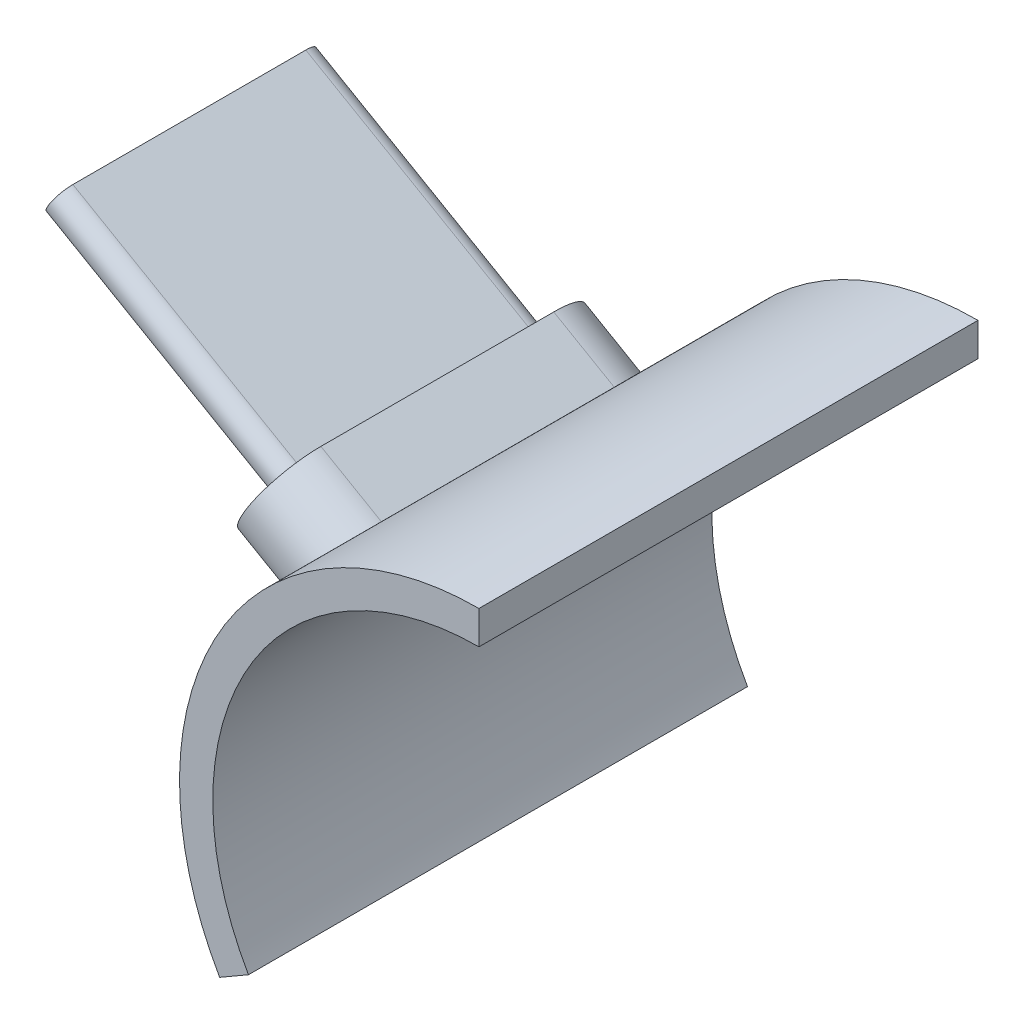
ISO-10303-21;
HEADER;
FILE_DESCRIPTION(('STEP AP214'),'2;1');
FILE_NAME('part.step','',(''),(''),'','','');
FILE_SCHEMA(('AUTOMOTIVE_DESIGN { 1 0 10303 214 1 1 1 1 }'));
ENDSEC;
DATA;
#1=APPLICATION_CONTEXT('core data for automotive mechanical design processes');
#2=APPLICATION_PROTOCOL_DEFINITION('international standard','automotive_design',2000,#1);
#3=PRODUCT_CONTEXT('',#1,'mechanical');
#4=PRODUCT('Part','Part','',(#3));
#5=PRODUCT_RELATED_PRODUCT_CATEGORY('part','',(#4));
#6=PRODUCT_DEFINITION_FORMATION('','',#4);
#7=PRODUCT_DEFINITION_CONTEXT('part definition',#1,'design');
#8=PRODUCT_DEFINITION('design','',#6,#7);
#9=PRODUCT_DEFINITION_SHAPE('','',#8);
#10=(LENGTH_UNIT() NAMED_UNIT(*) SI_UNIT(.MILLI.,.METRE.));
#11=(NAMED_UNIT(*) PLANE_ANGLE_UNIT() SI_UNIT($,.RADIAN.));
#12=(NAMED_UNIT(*) SI_UNIT($,.STERADIAN.) SOLID_ANGLE_UNIT());
#13=UNCERTAINTY_MEASURE_WITH_UNIT(LENGTH_MEASURE(1.E-05),#10,'distance_accuracy_value','');
#14=(GEOMETRIC_REPRESENTATION_CONTEXT(3) GLOBAL_UNCERTAINTY_ASSIGNED_CONTEXT((#13)) GLOBAL_UNIT_ASSIGNED_CONTEXT((#10,
#11,#12)) REPRESENTATION_CONTEXT('',''));
#15=CARTESIAN_POINT('',(0.,0.,0.));
#16=DIRECTION('',(0.,0.,1.));
#17=DIRECTION('',(1.,0.,0.));
#18=AXIS2_PLACEMENT_3D('',#15,#16,#17);
#19=CARTESIAN_POINT('',(0.,0.,-15.));
#20=DIRECTION('',(0.,0.,1.));
#21=DIRECTION('',(1.,0.,0.));
#22=AXIS2_PLACEMENT_3D('',#19,#20,#21);
#23=CYLINDRICAL_SURFACE('',#22,9.);
#24=CARTESIAN_POINT('',(0.,0.,0.));
#25=DIRECTION('',(0.,0.,1.));
#26=DIRECTION('',(1.,0.,0.));
#27=AXIS2_PLACEMENT_3D('',#24,#25,#26);
#28=CIRCLE('',#27,9.);
#29=CARTESIAN_POINT('',(0.,9.,0.));
#30=VERTEX_POINT('',#29);
#31=CARTESIAN_POINT('',(-7.79422863405995,-4.5,0.));
#32=VERTEX_POINT('',#31);
#33=EDGE_CURVE('E224',#30,#32,#28,.T.);
#34=ORIENTED_EDGE('',*,*,#33,.F.);
#35=DIRECTION('',(0.,0.,1.));
#36=VECTOR('',#35,1.);
#37=CARTESIAN_POINT('',(0.,9.,-15.));
#38=LINE('',#37,#36);
#39=CARTESIAN_POINT('',(0.,9.,-15.));
#40=VERTEX_POINT('',#39);
#41=EDGE_CURVE('E42',#40,#30,#38,.T.);
#42=ORIENTED_EDGE('',*,*,#41,.F.);
#43=CARTESIAN_POINT('',(0.,0.,-15.));
#44=DIRECTION('',(0.,0.,1.));
#45=DIRECTION('',(1.,0.,0.));
#46=AXIS2_PLACEMENT_3D('',#43,#44,#45);
#47=CIRCLE('',#46,9.);
#48=CARTESIAN_POINT('',(-7.79422863405995,-4.5,-15.));
#49=VERTEX_POINT('',#48);
#50=EDGE_CURVE('E238',#40,#49,#47,.T.);
#51=ORIENTED_EDGE('',*,*,#50,.T.);
#52=DIRECTION('',(0.,0.,1.));
#53=VECTOR('',#52,1.);
#54=CARTESIAN_POINT('',(-7.79422863405995,-4.5,-15.));
#55=LINE('',#54,#53);
#56=EDGE_CURVE('E228',#49,#32,#55,.T.);
#57=ORIENTED_EDGE('',*,*,#56,.T.);
#58=EDGE_LOOP('',(#34,#42,#51,#57));
#59=FACE_BOUND('',#58,.T.);
#60=DIRECTION('',(0.,0.,1.));
#61=VECTOR('',#60,1.);
#62=CARTESIAN_POINT('',(-6.9027682303927,5.77510093050167,-15.));
#63=LINE('',#62,#61);
#64=CARTESIAN_POINT('',(-6.90276823038147,5.77510093047241,-11.));
#65=VERTEX_POINT('',#64);
#66=CARTESIAN_POINT('',(-6.90276823030445,5.77510093040701,-4.00000000000002));
#67=VERTEX_POINT('',#66);
#68=EDGE_CURVE('E131',#65,#67,#63,.T.);
#69=ORIENTED_EDGE('',*,*,#68,.T.);
#70=CARTESIAN_POINT('',(-6.90276823038147,5.77510093047241,-4.00000000000002));
#71=CARTESIAN_POINT('',(-6.90276656012557,5.7751000768113,-3.95673706142056));
#72=CARTESIAN_POINT('',(-6.90394905667885,5.77368984360708,-3.91349517129641));
#73=CARTESIAN_POINT('',(-6.90865443831512,5.76805979386682,-3.8273272444447));
#74=CARTESIAN_POINT('',(-6.91217708068879,5.76384026869771,-3.78440117542836));
#75=CARTESIAN_POINT('',(-6.92619311311248,5.74700579029246,-3.65668125930244));
#76=CARTESIAN_POINT('',(-6.94013486813303,5.73021482392487,-3.57275310005166));
#77=CARTESIAN_POINT('',(-6.97653028283284,5.68584540154504,-3.40976931587298));
#78=CARTESIAN_POINT('',(-6.9989856695399,5.6582647567627,-3.33071468334683));
#79=CARTESIAN_POINT('',(-7.05134445339842,5.59287844897921,-3.17960231444207));
#80=CARTESIAN_POINT('',(-7.08124805188643,5.55507250957034,-3.10754476727856));
#81=CARTESIAN_POINT('',(-7.14747692440413,5.46959916990273,-2.97174357530146));
#82=CARTESIAN_POINT('',(-7.18385935644438,5.42184329230923,-2.90808351955007));
#83=CARTESIAN_POINT('',(-7.26130633177196,5.31767197783094,-2.79159955017666));
#84=CARTESIAN_POINT('',(-7.30237159228788,5.26125521397325,-2.73877729996561));
#85=CARTESIAN_POINT('',(-7.38780188681094,5.14061016034372,-2.64515893891145));
#86=CARTESIAN_POINT('',(-7.43218627472106,5.07633439871693,-2.60444158089755));
#87=CARTESIAN_POINT('',(-7.52230958901175,4.94180182845118,-2.53669706389918));
#88=CARTESIAN_POINT('',(-7.56804834418821,4.87154577368762,-2.50966818232274));
#89=CARTESIAN_POINT('',(-7.6587883222243,4.72759199504411,-2.47032349329807));
#90=CARTESIAN_POINT('',(-7.70379237590923,4.65393487457227,-2.4578657179893));
#91=CARTESIAN_POINT('',(-7.79206159911421,4.50458627160918,-2.44757509644643));
#92=CARTESIAN_POINT('',(-7.83532685326366,4.42889488842781,-2.4497415375654));
#93=CARTESIAN_POINT('',(-7.91844536375379,4.27849632161908,-2.46852814830906));
#94=CARTESIAN_POINT('',(-7.95832988076042,4.2037871989406,-2.484995127766));
#95=CARTESIAN_POINT('',(-8.03427347795219,4.05675986598687,-2.5316737814828));
#96=CARTESIAN_POINT('',(-8.0703324604456,3.98444171680176,-2.56188580664228));
#97=CARTESIAN_POINT('',(-8.13814892497099,3.84404034464471,-2.63534812000775));
#98=CARTESIAN_POINT('',(-8.16988457214322,3.77597949420322,-2.67866127386927));
#99=CARTESIAN_POINT('',(-8.22845541624945,3.64658378473835,-2.77704874019919));
#100=CARTESIAN_POINT('',(-8.25529036866384,3.58524926138523,-2.83212363922124));
#101=CARTESIAN_POINT('',(-8.30418277429193,3.47051788733601,-2.95331108653863));
#102=CARTESIAN_POINT('',(-8.32617451103861,3.41723297994059,-3.01955618888776));
#103=CARTESIAN_POINT('',(-8.36488687173686,3.32134772536017,-3.16078398358874));
#104=CARTESIAN_POINT('',(-8.38160600110984,3.27875040838851,-3.23576914517179));
#105=CARTESIAN_POINT('',(-8.40981251458721,3.20571288928587,-3.39251518925667));
#106=CARTESIAN_POINT('',(-8.42129030358781,3.17529499595326,-3.47428817723921));
#107=CARTESIAN_POINT('',(-8.43900459124829,3.12791498189281,-3.64211822813732));
#108=CARTESIAN_POINT('',(-8.44524892052809,3.11093276003902,-3.72816868572735));
#109=CARTESIAN_POINT('',(-8.45019184775187,3.09746103512405,-3.84573238699263));
#110=CARTESIAN_POINT('',(-8.45115894139542,3.09482071087173,-3.87654608855297));
#111=CARTESIAN_POINT('',(-8.45244620814087,3.09130351700679,-3.93823534579796));
#112=CARTESIAN_POINT('',(-8.45276746899528,3.09042368227782,-3.96911070965883));
#113=CARTESIAN_POINT('',(-8.45276823041337,3.09042217875073,-3.99999999999618));
#114=B_SPLINE_CURVE_WITH_KNOTS('',3,(#70,#71,#72,#73,#74,#75,#76,#77,#78,#79,#80,#81,#82,#83,
#84,#85,#86,#87,#88,#89,#90,#91,#92,#93,#94,#95,#96,#97,#98,#99,#100,#101,#102,#103,#104,#105,
#106,#107,#108,#109,#110,#111,#112,#113),.UNSPECIFIED.,.F.,.F.,(4,2,2,2,2,2,2,2,2,2,2,2,2,2,2,2,
2,2,2,2,2,4),(0.,0.129708064181739,0.259402677730728,0.518221537235833,0.777092927405544,
1.03597131602446,1.29725827954864,1.5585853160387,1.8215770666274,2.08453571345017,
2.34491040178055,2.60527240198601,2.86287928351456,3.12049274190214,3.37936251327546,
3.63824519739915,3.90044953013556,4.16272812090841,4.42548494808099,4.68784791708554,
4.78063019805032,4.87325607785096),.UNSPECIFIED.);
#115=CARTESIAN_POINT('',(-8.45276823031327,3.09042217867272,-4.00000000000001));
#116=VERTEX_POINT('',#115);
#117=EDGE_CURVE('E141',#67,#116,#114,.T.);
#118=ORIENTED_EDGE('',*,*,#117,.T.);
#119=DIRECTION('',(0.,0.,1.));
#120=VECTOR('',#119,1.);
#121=CARTESIAN_POINT('',(-8.45276823041012,3.09042217875961,-15.));
#122=LINE('',#121,#120);
#123=CARTESIAN_POINT('',(-8.45276823041696,3.09042217874091,-11.));
#124=VERTEX_POINT('',#123);
#125=EDGE_CURVE('E137',#116,#124,#122,.F.);
#126=ORIENTED_EDGE('',*,*,#125,.T.);
#127=CARTESIAN_POINT('',(-8.45276823045459,3.09042217879927,-11.));
#128=CARTESIAN_POINT('',(-8.45276665598757,3.09042115912177,-11.0432629385792));
#129=CARTESIAN_POINT('',(-8.45213660646545,3.09215034776536,-11.0865048287031));
#130=CARTESIAN_POINT('',(-8.44961353117242,3.09904035264977,-11.1726727555558));
#131=CARTESIAN_POINT('',(-8.44772063637798,3.10420081301477,-11.2155988245733));
#132=CARTESIAN_POINT('',(-8.44014956664546,3.1247562923436,-11.3433187407016));
#133=CARTESIAN_POINT('',(-8.43257904072712,3.14522568953695,-11.4272468999551));
#134=CARTESIAN_POINT('',(-8.41235170113984,3.19892975444215,-11.5902306841296));
#135=CARTESIAN_POINT('',(-8.39969385545417,3.2321670121893,-11.6692853166487));
#136=CARTESIAN_POINT('',(-8.36924704378071,3.3102042030222,-11.8203976855517));
#137=CARTESIAN_POINT('',(-8.35145793908506,3.35500444867444,-11.8924552327204));
#138=CARTESIAN_POINT('',(-8.31055029184703,3.45509700456702,-12.0282564247));
#139=CARTESIAN_POINT('',(-8.28738370469049,3.51048305376372,-12.0919164804488));
#140=CARTESIAN_POINT('',(-8.2358921876685,3.62963975908656,-12.2084004498128));
#141=CARTESIAN_POINT('',(-8.20756646722509,3.69341169983735,-12.2612227000169));
#142=CARTESIAN_POINT('',(-8.14579993320081,3.82771903196447,-12.3548410610739));
#143=CARTESIAN_POINT('',(-8.11232768473871,3.89829492024037,-12.3955584190968));
#144=CARTESIAN_POINT('',(-8.04088071839379,4.04361028502803,-12.4633029361024));
#145=CARTESIAN_POINT('',(-8.00290656778418,4.11834923633497,-12.4903318176773));
#146=CARTESIAN_POINT('',(-7.92360892752298,4.26890925177885,-12.5296765067015));
#147=CARTESIAN_POINT('',(-7.88232201686713,4.34471246577827,-12.5421342820121));
#148=CARTESIAN_POINT('',(-7.79711694428292,4.49583015692723,-12.5524249035552));
#149=CARTESIAN_POINT('',(-7.75319891067411,4.57114465771303,-12.5502584624345));
#150=CARTESIAN_POINT('',(-7.66450918636719,4.71832668272931,-12.5314718516839));
#151=CARTESIAN_POINT('',(-7.61975144673448,4.79022224901612,-12.5150048722211));
#152=CARTESIAN_POINT('',(-7.53039383993771,4.92950499992005,-12.4683262185012));
#153=CARTESIAN_POINT('',(-7.4857939768334,4.99689206938868,-12.4381141933447));
#154=CARTESIAN_POINT('',(-7.398111054077,5.1258235365456,-12.364651879993));
#155=CARTESIAN_POINT('',(-7.35503645217462,5.18733783842597,-12.3213387261434));
#156=CARTESIAN_POINT('',(-7.27226190269908,5.30275953206202,-12.2229512598057));
#157=CARTESIAN_POINT('',(-7.23256212356516,5.35666654422226,-12.1678763607639));
#158=CARTESIAN_POINT('',(-7.15764804184855,5.45637429656213,-12.0466889134369));
#159=CARTESIAN_POINT('',(-7.1224978267743,5.50206215296183,-11.9804438110983));
#160=CARTESIAN_POINT('',(-7.05881494080983,5.58353066805527,-11.839216016409));
#161=CARTESIAN_POINT('',(-7.03028414687195,5.61930851729945,-11.7642308548271));
#162=CARTESIAN_POINT('',(-6.98113505661614,5.68025483410069,-11.6074848107528));
#163=CARTESIAN_POINT('',(-6.96053128273305,5.70540383765408,-11.5257118227792));
#164=CARTESIAN_POINT('',(-6.92835613077477,5.74443486778446,-11.3578817718727));
#165=CARTESIAN_POINT('',(-6.91677125992379,5.75833372644027,-11.2718313142655));
#166=CARTESIAN_POINT('',(-6.90757586749639,5.76935028947844,-11.1542676129983));
#167=CARTESIAN_POINT('',(-6.90577282642489,5.77150797928752,-11.1234539114406));
#168=CARTESIAN_POINT('',(-6.90337048055001,5.77438138193561,-11.061764654199));
#169=CARTESIAN_POINT('',(-6.90276915175675,5.77509951935414,-11.0308892903389));
#170=CARTESIAN_POINT('',(-6.90276823041025,5.77510093048069,-10.9999999999985));
#171=B_SPLINE_CURVE_WITH_KNOTS('',3,(#127,#128,#129,#130,#131,#132,#133,#134,#135,#136,#137,
#138,#139,#140,#141,#142,#143,#144,#145,#146,#147,#148,#149,#150,#151,#152,#153,#154,#155,#156,
#157,#158,#159,#160,#161,#162,#163,#164,#165,#166,#167,#168,#169,#170),.UNSPECIFIED.,.F.,.F.,(4,
2,2,2,2,2,2,2,2,2,2,2,2,2,2,2,2,2,2,2,2,4),(0.,0.129708064180416,0.259402677730961,
0.518221537231424,0.77709292740258,1.03597131602412,1.29725827954323,1.55858531602877,
1.82157706663297,2.08453571346949,2.34491040179906,2.60527240200623,2.86287928354662,
3.12049274194263,3.37936251330388,3.63824519741953,3.90044953014789,4.16272812090916,
4.42548494809246,4.68784791710967,4.78063019807363,4.87325607787292),.UNSPECIFIED.);
#172=EDGE_CURVE('E49',#124,#65,#171,.T.);
#173=ORIENTED_EDGE('',*,*,#172,.T.);
#174=EDGE_LOOP('',(#69,#118,#126,#173));
#175=FACE_BOUND('',#174,.T.);
#176=ADVANCED_FACE('F35',(#59,#175),#23,.T.);
#177=CARTESIAN_POINT('',(0.,9.,-15.));
#178=DIRECTION('',(1.,0.,0.));
#179=DIRECTION('',(0.,0.,-1.));
#180=AXIS2_PLACEMENT_3D('',#177,#178,#179);
#181=PLANE('',#180);
#182=DIRECTION('',(0.,1.,0.));
#183=VECTOR('',#182,1.);
#184=CARTESIAN_POINT('',(0.,9.,0.));
#185=LINE('',#184,#183);
#186=CARTESIAN_POINT('',(0.,8.,0.));
#187=VERTEX_POINT('',#186);
#188=EDGE_CURVE('E235',#187,#30,#185,.T.);
#189=ORIENTED_EDGE('',*,*,#188,.F.);
#190=DIRECTION('',(0.,0.,1.));
#191=VECTOR('',#190,1.);
#192=CARTESIAN_POINT('',(0.,8.,-15.));
#193=LINE('',#192,#191);
#194=CARTESIAN_POINT('',(0.,8.,-15.));
#195=VERTEX_POINT('',#194);
#196=EDGE_CURVE('E246',#195,#187,#193,.T.);
#197=ORIENTED_EDGE('',*,*,#196,.F.);
#198=DIRECTION('',(0.,1.,0.));
#199=VECTOR('',#198,1.);
#200=CARTESIAN_POINT('',(0.,9.,-15.));
#201=LINE('',#200,#199);
#202=EDGE_CURVE('E249',#195,#40,#201,.T.);
#203=ORIENTED_EDGE('',*,*,#202,.T.);
#204=ORIENTED_EDGE('',*,*,#41,.T.);
#205=EDGE_LOOP('',(#189,#197,#203,#204));
#206=FACE_BOUND('',#205,.T.);
#207=ADVANCED_FACE('F206',(#206),#181,.T.);
#208=CARTESIAN_POINT('',(0.,0.,-15.));
#209=DIRECTION('',(0.,0.,1.));
#210=DIRECTION('',(1.,0.,0.));
#211=AXIS2_PLACEMENT_3D('',#208,#209,#210);
#212=CYLINDRICAL_SURFACE('',#211,8.);
#213=CARTESIAN_POINT('',(0.,0.,0.));
#214=DIRECTION('',(0.,0.,-1.));
#215=DIRECTION('',(1.,0.,0.));
#216=AXIS2_PLACEMENT_3D('',#213,#214,#215);
#217=CIRCLE('',#216,8.);
#218=CARTESIAN_POINT('',(-6.92820323027551,-3.99999999999999,0.));
#219=VERTEX_POINT('',#218);
#220=EDGE_CURVE('E237',#219,#187,#217,.T.);
#221=ORIENTED_EDGE('',*,*,#220,.F.);
#222=DIRECTION('',(0.,0.,1.));
#223=VECTOR('',#222,1.);
#224=CARTESIAN_POINT('',(-6.92820323027551,-3.99999999999999,-15.));
#225=LINE('',#224,#223);
#226=CARTESIAN_POINT('',(-6.92820323027551,-3.99999999999999,-15.));
#227=VERTEX_POINT('',#226);
#228=EDGE_CURVE('E248',#227,#219,#225,.T.);
#229=ORIENTED_EDGE('',*,*,#228,.F.);
#230=CARTESIAN_POINT('',(0.,0.,-15.));
#231=DIRECTION('',(0.,0.,-1.));
#232=DIRECTION('',(1.,0.,0.));
#233=AXIS2_PLACEMENT_3D('',#230,#231,#232);
#234=CIRCLE('',#233,8.);
#235=EDGE_CURVE('E251',#227,#195,#234,.T.);
#236=ORIENTED_EDGE('',*,*,#235,.T.);
#237=ORIENTED_EDGE('',*,*,#196,.T.);
#238=EDGE_LOOP('',(#221,#229,#236,#237));
#239=FACE_BOUND('',#238,.T.);
#240=ADVANCED_FACE('F209',(#239),#212,.F.);
#241=CARTESIAN_POINT('',(-7.79422863405995,-4.5,-15.));
#242=DIRECTION('',(0.5,-0.866025403784438,0.));
#243=DIRECTION('',(0.866025403784439,0.5,0.));
#244=AXIS2_PLACEMENT_3D('',#241,#242,#243);
#245=PLANE('',#244);
#246=DIRECTION('',(0.866025403784438,0.5,0.));
#247=VECTOR('',#246,1.);
#248=CARTESIAN_POINT('',(-7.79422863405995,-4.5,0.));
#249=LINE('',#248,#247);
#250=EDGE_CURVE('E230',#32,#219,#249,.T.);
#251=ORIENTED_EDGE('',*,*,#250,.F.);
#252=ORIENTED_EDGE('',*,*,#56,.F.);
#253=DIRECTION('',(0.866025403784438,0.5,0.));
#254=VECTOR('',#253,1.);
#255=CARTESIAN_POINT('',(-7.79422863405995,-4.5,-15.));
#256=LINE('',#255,#254);
#257=EDGE_CURVE('E240',#49,#227,#256,.T.);
#258=ORIENTED_EDGE('',*,*,#257,.T.);
#259=ORIENTED_EDGE('',*,*,#228,.T.);
#260=EDGE_LOOP('',(#251,#252,#258,#259));
#261=FACE_BOUND('',#260,.T.);
#262=ADVANCED_FACE('F201',(#261),#245,.T.);
#263=CARTESIAN_POINT('',(0.,0.,-15.));
#264=DIRECTION('',(0.,0.,1.));
#265=DIRECTION('',(1.,0.,0.));
#266=AXIS2_PLACEMENT_3D('',#263,#264,#265);
#267=PLANE('',#266);
#268=ORIENTED_EDGE('',*,*,#50,.F.);
#269=ORIENTED_EDGE('',*,*,#202,.F.);
#270=ORIENTED_EDGE('',*,*,#235,.F.);
#271=ORIENTED_EDGE('',*,*,#257,.F.);
#272=EDGE_LOOP('',(#268,#269,#270,#271));
#273=FACE_BOUND('',#272,.T.);
#274=ADVANCED_FACE('F198',(#273),#267,.F.);
#275=CARTESIAN_POINT('',(0.,0.,0.));
#276=DIRECTION('',(0.,0.,1.));
#277=DIRECTION('',(1.,0.,0.));
#278=AXIS2_PLACEMENT_3D('',#275,#276,#277);
#279=PLANE('',#278);
#280=ORIENTED_EDGE('',*,*,#33,.T.);
#281=ORIENTED_EDGE('',*,*,#250,.T.);
#282=ORIENTED_EDGE('',*,*,#220,.T.);
#283=ORIENTED_EDGE('',*,*,#188,.T.);
#284=EDGE_LOOP('',(#280,#281,#282,#283));
#285=FACE_BOUND('',#284,.T.);
#286=ADVANCED_FACE('F165',(#285),#279,.T.);
#287=CARTESIAN_POINT('',(-9.52627944162882,5.50000000000001,-3.99999999999995));
#288=DIRECTION('',(-0.866025403784438,0.500000000000001,0.));
#289=DIRECTION('',(-0.500000000000001,-0.866025403784438,0.));
#290=AXIS2_PLACEMENT_3D('',#287,#288,#289);
#291=PLANE('',#290);
#292=CARTESIAN_POINT('',(-9.52627944162882,5.50000000000001,-3.99999999999995));
#293=DIRECTION('',(-0.866025403784438,0.500000000000001,0.));
#294=DIRECTION('',(-0.500000000000001,-0.866025403784438,0.));
#295=AXIS2_PLACEMENT_3D('',#292,#293,#294);
#296=CIRCLE('',#295,1.55);
#297=CARTESIAN_POINT('',(-10.3012794416288,4.15766062413413,-4.00000000000001));
#298=VERTEX_POINT('',#297);
#299=CARTESIAN_POINT('',(-8.75127944162882,6.84233937586589,-4.00000000000002));
#300=VERTEX_POINT('',#299);
#301=EDGE_CURVE('E143',#298,#300,#296,.T.);
#302=ORIENTED_EDGE('',*,*,#301,.T.);
#303=DIRECTION('',(0.,0.,-1.));
#304=VECTOR('',#303,1.);
#305=CARTESIAN_POINT('',(-8.75127944162882,6.84233937586589,-4.00000000000002));
#306=LINE('',#305,#304);
#307=CARTESIAN_POINT('',(-8.75127944162882,6.84233937586589,-11.));
#308=VERTEX_POINT('',#307);
#309=EDGE_CURVE('E295',#300,#308,#306,.T.);
#310=ORIENTED_EDGE('',*,*,#309,.T.);
#311=CARTESIAN_POINT('',(-9.52627944162882,5.50000000000001,-10.9999999999999));
#312=DIRECTION('',(-0.866025403784438,0.500000000000001,0.));
#313=DIRECTION('',(-0.500000000000001,-0.866025403784438,0.));
#314=AXIS2_PLACEMENT_3D('',#311,#312,#313);
#315=CIRCLE('',#314,1.55);
#316=CARTESIAN_POINT('',(-10.3012794416288,4.15766062413413,-11.));
#317=VERTEX_POINT('',#316);
#318=EDGE_CURVE('E125',#308,#317,#315,.T.);
#319=ORIENTED_EDGE('',*,*,#318,.T.);
#320=DIRECTION('',(0.,0.,1.));
#321=VECTOR('',#320,1.);
#322=CARTESIAN_POINT('',(-10.3012794416288,4.15766062413413,-11.));
#323=LINE('',#322,#321);
#324=EDGE_CURVE('E292',#317,#298,#323,.T.);
#325=ORIENTED_EDGE('',*,*,#324,.T.);
#326=EDGE_LOOP('',(#302,#310,#319,#325));
#327=FACE_BOUND('',#326,.T.);
#328=CARTESIAN_POINT('',(-9.52627944162882,5.50000000000001,-11.));
#329=DIRECTION('',(-0.866025403784438,0.500000000000001,0.));
#330=DIRECTION('',(-0.500000000000001,-0.866025403784438,0.));
#331=AXIS2_PLACEMENT_3D('',#328,#329,#330);
#332=CIRCLE('',#331,0.5);
#333=CARTESIAN_POINT('',(-9.27627944162882,5.93301270189223,-11.));
#334=VERTEX_POINT('',#333);
#335=CARTESIAN_POINT('',(-9.77627944162882,5.06698729810779,-11.));
#336=VERTEX_POINT('',#335);
#337=EDGE_CURVE('E57',#334,#336,#332,.T.);
#338=ORIENTED_EDGE('',*,*,#337,.F.);
#339=DIRECTION('',(0.,0.,-1.));
#340=VECTOR('',#339,1.);
#341=CARTESIAN_POINT('',(-9.27627944162882,5.93301270189223,-11.));
#342=LINE('',#341,#340);
#343=CARTESIAN_POINT('',(-9.27627944162882,5.93301270189223,-4.));
#344=VERTEX_POINT('',#343);
#345=EDGE_CURVE('E11',#344,#334,#342,.T.);
#346=ORIENTED_EDGE('',*,*,#345,.F.);
#347=CARTESIAN_POINT('',(-9.52627944162882,5.50000000000001,-4.));
#348=DIRECTION('',(-0.866025403784438,0.500000000000001,0.));
#349=DIRECTION('',(-0.500000000000001,-0.866025403784438,0.));
#350=AXIS2_PLACEMENT_3D('',#347,#348,#349);
#351=CIRCLE('',#350,0.5);
#352=CARTESIAN_POINT('',(-9.77627944162882,5.06698729810779,-4.));
#353=VERTEX_POINT('',#352);
#354=EDGE_CURVE('E285',#353,#344,#351,.T.);
#355=ORIENTED_EDGE('',*,*,#354,.F.);
#356=DIRECTION('',(0.,0.,1.));
#357=VECTOR('',#356,1.);
#358=CARTESIAN_POINT('',(-9.77627944162882,5.06698729810779,-11.));
#359=LINE('',#358,#357);
#360=EDGE_CURVE('E282',#336,#353,#359,.T.);
#361=ORIENTED_EDGE('',*,*,#360,.F.);
#362=EDGE_LOOP('',(#338,#346,#355,#361));
#363=FACE_BOUND('',#362,.T.);
#364=ADVANCED_FACE('F161',(#327,#363),#291,.T.);
#365=CARTESIAN_POINT('',(-9.52627944162882,5.50000000000001,-3.99999999999995));
#366=DIRECTION('',(0.866025403784438,-0.500000000000001,0.));
#367=DIRECTION('',(0.500000000000001,0.866025403784438,0.));
#368=AXIS2_PLACEMENT_3D('',#365,#366,#367);
#369=CYLINDRICAL_SURFACE('',#368,1.55);
#370=DIRECTION('',(0.866025403784438,-0.500000000000001,0.));
#371=VECTOR('',#370,1.);
#372=CARTESIAN_POINT('',(-10.3012794416288,4.15766062413413,-4.00000000000001));
#373=LINE('',#372,#371);
#374=EDGE_CURVE('E290',#298,#116,#373,.T.);
#375=ORIENTED_EDGE('',*,*,#374,.T.);
#376=ORIENTED_EDGE('',*,*,#117,.F.);
#377=DIRECTION('',(0.866025403784438,-0.500000000000001,0.));
#378=VECTOR('',#377,1.);
#379=CARTESIAN_POINT('',(-8.75127944162882,6.84233937586589,-4.00000000000002));
#380=LINE('',#379,#378);
#381=EDGE_CURVE('E127',#300,#67,#380,.T.);
#382=ORIENTED_EDGE('',*,*,#381,.F.);
#383=ORIENTED_EDGE('',*,*,#301,.F.);
#384=EDGE_LOOP('',(#375,#376,#382,#383));
#385=FACE_BOUND('',#384,.T.);
#386=ADVANCED_FACE('F164',(#385),#369,.T.);
#387=CARTESIAN_POINT('',(-8.75127944162882,6.84233937586589,-4.00000000000002));
#388=DIRECTION('',(-0.500000000000001,-0.866025403784438,0.));
#389=DIRECTION('',(0.866025403784438,-0.500000000000001,0.));
#390=AXIS2_PLACEMENT_3D('',#387,#388,#389);
#391=PLANE('',#390);
#392=ORIENTED_EDGE('',*,*,#381,.T.);
#393=ORIENTED_EDGE('',*,*,#68,.F.);
#394=DIRECTION('',(0.866025403784438,-0.500000000000001,0.));
#395=VECTOR('',#394,1.);
#396=CARTESIAN_POINT('',(-8.75127944162882,6.84233937586589,-11.));
#397=LINE('',#396,#395);
#398=EDGE_CURVE('E122',#308,#65,#397,.T.);
#399=ORIENTED_EDGE('',*,*,#398,.F.);
#400=ORIENTED_EDGE('',*,*,#309,.F.);
#401=EDGE_LOOP('',(#392,#393,#399,#400));
#402=FACE_BOUND('',#401,.T.);
#403=ADVANCED_FACE('F132',(#402),#391,.F.);
#404=CARTESIAN_POINT('',(-9.52627944162882,5.50000000000001,-10.9999999999999));
#405=DIRECTION('',(0.866025403784438,-0.500000000000001,0.));
#406=DIRECTION('',(0.500000000000001,0.866025403784438,0.));
#407=AXIS2_PLACEMENT_3D('',#404,#405,#406);
#408=CYLINDRICAL_SURFACE('',#407,1.55);
#409=ORIENTED_EDGE('',*,*,#398,.T.);
#410=ORIENTED_EDGE('',*,*,#172,.F.);
#411=DIRECTION('',(0.866025403784438,-0.500000000000001,0.));
#412=VECTOR('',#411,1.);
#413=CARTESIAN_POINT('',(-10.3012794416288,4.15766062413413,-11.));
#414=LINE('',#413,#412);
#415=EDGE_CURVE('E128',#317,#124,#414,.T.);
#416=ORIENTED_EDGE('',*,*,#415,.F.);
#417=ORIENTED_EDGE('',*,*,#318,.F.);
#418=EDGE_LOOP('',(#409,#410,#416,#417));
#419=FACE_BOUND('',#418,.T.);
#420=ADVANCED_FACE('F124',(#419),#408,.T.);
#421=CARTESIAN_POINT('',(-10.3012794416288,4.15766062413413,-11.));
#422=DIRECTION('',(0.500000000000001,0.866025403784438,0.));
#423=DIRECTION('',(-0.866025403784438,0.500000000000001,0.));
#424=AXIS2_PLACEMENT_3D('',#421,#422,#423);
#425=PLANE('',#424);
#426=ORIENTED_EDGE('',*,*,#415,.T.);
#427=ORIENTED_EDGE('',*,*,#125,.F.);
#428=ORIENTED_EDGE('',*,*,#374,.F.);
#429=ORIENTED_EDGE('',*,*,#324,.F.);
#430=EDGE_LOOP('',(#426,#427,#428,#429));
#431=FACE_BOUND('',#430,.T.);
#432=ADVANCED_FACE('F167',(#431),#425,.F.);
#433=CARTESIAN_POINT('',(-16.4544826719043,9.50000000000002,-11.));
#434=DIRECTION('',(-0.866025403784438,0.500000000000001,0.));
#435=DIRECTION('',(-0.500000000000001,-0.866025403784438,0.));
#436=AXIS2_PLACEMENT_3D('',#433,#434,#435);
#437=PLANE('',#436);
#438=CARTESIAN_POINT('',(-16.4544826719043,9.50000000000002,-11.));
#439=DIRECTION('',(-0.866025403784438,0.500000000000001,0.));
#440=DIRECTION('',(-0.500000000000001,-0.866025403784438,0.));
#441=AXIS2_PLACEMENT_3D('',#438,#439,#440);
#442=CIRCLE('',#441,0.5);
#443=CARTESIAN_POINT('',(-16.2044826719043,9.93301270189224,-11.));
#444=VERTEX_POINT('',#443);
#445=CARTESIAN_POINT('',(-16.7044826719043,9.0669872981078,-11.));
#446=VERTEX_POINT('',#445);
#447=EDGE_CURVE('E278',#444,#446,#442,.T.);
#448=ORIENTED_EDGE('',*,*,#447,.T.);
#449=DIRECTION('',(0.,0.,1.));
#450=VECTOR('',#449,1.);
#451=CARTESIAN_POINT('',(-16.7044826719043,9.0669872981078,-11.));
#452=LINE('',#451,#450);
#453=CARTESIAN_POINT('',(-16.7044826719043,9.0669872981078,-4.));
#454=VERTEX_POINT('',#453);
#455=EDGE_CURVE('E276',#446,#454,#452,.T.);
#456=ORIENTED_EDGE('',*,*,#455,.T.);
#457=CARTESIAN_POINT('',(-16.4544826719043,9.50000000000002,-4.));
#458=DIRECTION('',(-0.866025403784438,0.500000000000001,0.));
#459=DIRECTION('',(-0.500000000000001,-0.866025403784438,0.));
#460=AXIS2_PLACEMENT_3D('',#457,#458,#459);
#461=CIRCLE('',#460,0.5);
#462=CARTESIAN_POINT('',(-16.2044826719043,9.93301270189224,-4.));
#463=VERTEX_POINT('',#462);
#464=EDGE_CURVE('E274',#454,#463,#461,.T.);
#465=ORIENTED_EDGE('',*,*,#464,.T.);
#466=DIRECTION('',(0.,0.,-1.));
#467=VECTOR('',#466,1.);
#468=CARTESIAN_POINT('',(-16.2044826719043,9.93301270189224,-11.));
#469=LINE('',#468,#467);
#470=EDGE_CURVE('E272',#463,#444,#469,.T.);
#471=ORIENTED_EDGE('',*,*,#470,.T.);
#472=EDGE_LOOP('',(#448,#456,#465,#471));
#473=FACE_BOUND('',#472,.T.);
#474=ADVANCED_FACE('F170',(#473),#437,.T.);
#475=CARTESIAN_POINT('',(-16.2044826719043,9.93301270189224,-11.));
#476=DIRECTION('',(-0.500000000000001,-0.866025403784438,0.));
#477=DIRECTION('',(0.866025403784438,-0.500000000000001,0.));
#478=AXIS2_PLACEMENT_3D('',#475,#476,#477);
#479=PLANE('',#478);
#480=DIRECTION('',(0.866025403784438,-0.500000000000001,0.));
#481=VECTOR('',#480,1.);
#482=CARTESIAN_POINT('',(-16.2044826719043,9.93301270189224,-4.));
#483=LINE('',#482,#481);
#484=EDGE_CURVE('E266',#463,#344,#483,.T.);
#485=ORIENTED_EDGE('',*,*,#484,.T.);
#486=ORIENTED_EDGE('',*,*,#345,.T.);
#487=DIRECTION('',(0.866025403784438,-0.500000000000001,0.));
#488=VECTOR('',#487,1.);
#489=CARTESIAN_POINT('',(-16.2044826719043,9.93301270189224,-11.));
#490=LINE('',#489,#488);
#491=EDGE_CURVE('E269',#444,#334,#490,.T.);
#492=ORIENTED_EDGE('',*,*,#491,.F.);
#493=ORIENTED_EDGE('',*,*,#470,.F.);
#494=EDGE_LOOP('',(#485,#486,#492,#493));
#495=FACE_BOUND('',#494,.T.);
#496=ADVANCED_FACE('F181',(#495),#479,.F.);
#497=CARTESIAN_POINT('',(-16.4544826719043,9.50000000000002,-4.));
#498=DIRECTION('',(0.866025403784438,-0.500000000000001,0.));
#499=DIRECTION('',(0.500000000000001,0.866025403784438,0.));
#500=AXIS2_PLACEMENT_3D('',#497,#498,#499);
#501=CYLINDRICAL_SURFACE('',#500,0.5);
#502=DIRECTION('',(0.866025403784438,-0.500000000000001,0.));
#503=VECTOR('',#502,1.);
#504=CARTESIAN_POINT('',(-16.7044826719043,9.0669872981078,-4.));
#505=LINE('',#504,#503);
#506=EDGE_CURVE('E263',#454,#353,#505,.T.);
#507=ORIENTED_EDGE('',*,*,#506,.T.);
#508=ORIENTED_EDGE('',*,*,#354,.T.);
#509=ORIENTED_EDGE('',*,*,#484,.F.);
#510=ORIENTED_EDGE('',*,*,#464,.F.);
#511=EDGE_LOOP('',(#507,#508,#509,#510));
#512=FACE_BOUND('',#511,.T.);
#513=ADVANCED_FACE('F185',(#512),#501,.T.);
#514=CARTESIAN_POINT('',(-16.7044826719043,9.0669872981078,-11.));
#515=DIRECTION('',(0.500000000000001,0.866025403784438,0.));
#516=DIRECTION('',(-0.866025403784438,0.500000000000001,0.));
#517=AXIS2_PLACEMENT_3D('',#514,#515,#516);
#518=PLANE('',#517);
#519=DIRECTION('',(0.866025403784438,-0.500000000000001,0.));
#520=VECTOR('',#519,1.);
#521=CARTESIAN_POINT('',(-16.7044826719043,9.0669872981078,-11.));
#522=LINE('',#521,#520);
#523=EDGE_CURVE('E231',#446,#336,#522,.T.);
#524=ORIENTED_EDGE('',*,*,#523,.T.);
#525=ORIENTED_EDGE('',*,*,#360,.T.);
#526=ORIENTED_EDGE('',*,*,#506,.F.);
#527=ORIENTED_EDGE('',*,*,#455,.F.);
#528=EDGE_LOOP('',(#524,#525,#526,#527));
#529=FACE_BOUND('',#528,.T.);
#530=ADVANCED_FACE('F189',(#529),#518,.F.);
#531=CARTESIAN_POINT('',(-16.4544826719043,9.50000000000002,-11.));
#532=DIRECTION('',(0.866025403784438,-0.500000000000001,0.));
#533=DIRECTION('',(0.500000000000001,0.866025403784438,0.));
#534=AXIS2_PLACEMENT_3D('',#531,#532,#533);
#535=CYLINDRICAL_SURFACE('',#534,0.5);
#536=ORIENTED_EDGE('',*,*,#491,.T.);
#537=ORIENTED_EDGE('',*,*,#337,.T.);
#538=ORIENTED_EDGE('',*,*,#523,.F.);
#539=ORIENTED_EDGE('',*,*,#447,.F.);
#540=EDGE_LOOP('',(#536,#537,#538,#539));
#541=FACE_BOUND('',#540,.T.);
#542=ADVANCED_FACE('F193',(#541),#535,.T.);
#543=CLOSED_SHELL('',(#176,#207,#240,#262,#274,#286,#364,#386,#403,#420,#432,#474,#496,#513,
#530,#542));
#544=MANIFOLD_SOLID_BREP('B2',#543);
#545=ADVANCED_BREP_SHAPE_REPRESENTATION('',(#18,#544),#14);
#546=SHAPE_DEFINITION_REPRESENTATION(#9,#545);
ENDSEC;
END-ISO-10303-21;
